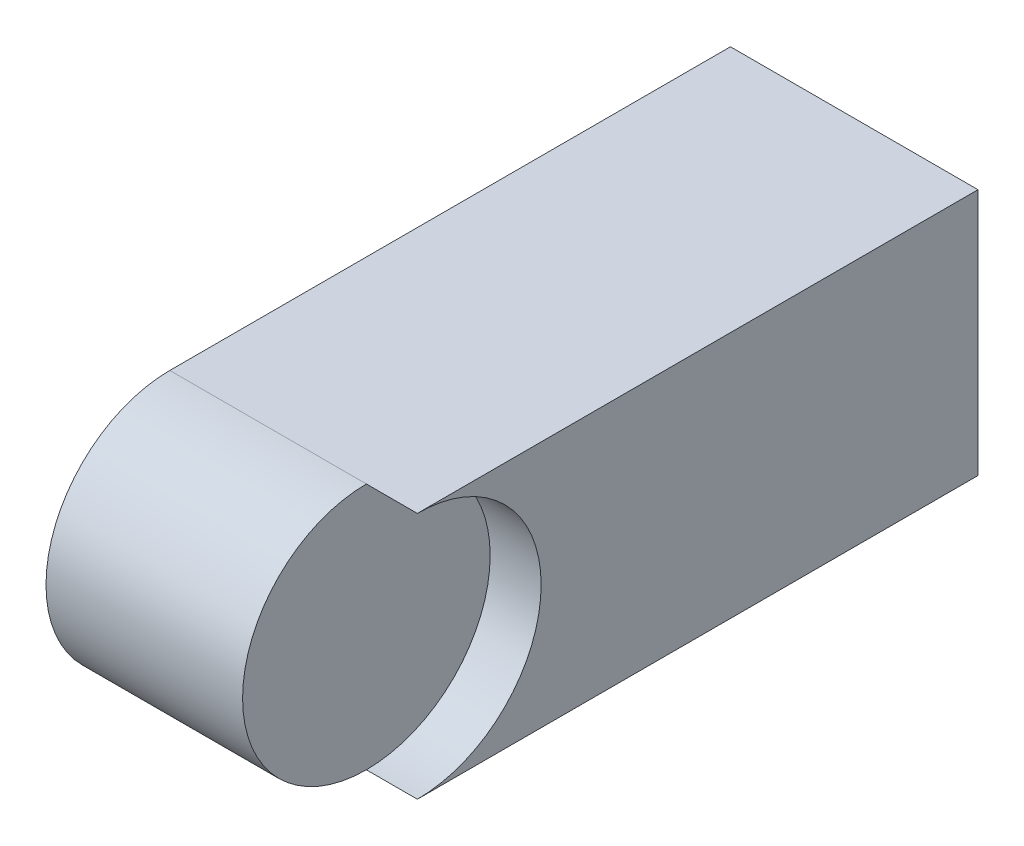
ISO-10303-21;
HEADER;
FILE_DESCRIPTION(('STEP AP214'),'2;1');
FILE_NAME('part.step','',(''),(''),'','','');
FILE_SCHEMA(('AUTOMOTIVE_DESIGN { 1 0 10303 214 1 1 1 1 }'));
ENDSEC;
DATA;
#1=APPLICATION_CONTEXT('core data for automotive mechanical design processes');
#2=APPLICATION_PROTOCOL_DEFINITION('international standard','automotive_design',2000,#1);
#3=PRODUCT_CONTEXT('',#1,'mechanical');
#4=PRODUCT('Part','Part','',(#3));
#5=PRODUCT_RELATED_PRODUCT_CATEGORY('part','',(#4));
#6=PRODUCT_DEFINITION_FORMATION('','',#4);
#7=PRODUCT_DEFINITION_CONTEXT('part definition',#1,'design');
#8=PRODUCT_DEFINITION('design','',#6,#7);
#9=PRODUCT_DEFINITION_SHAPE('','',#8);
#10=(LENGTH_UNIT() NAMED_UNIT(*) SI_UNIT(.MILLI.,.METRE.));
#11=(NAMED_UNIT(*) PLANE_ANGLE_UNIT() SI_UNIT($,.RADIAN.));
#12=(NAMED_UNIT(*) SI_UNIT($,.STERADIAN.) SOLID_ANGLE_UNIT());
#13=UNCERTAINTY_MEASURE_WITH_UNIT(LENGTH_MEASURE(1.E-05),#10,'distance_accuracy_value','');
#14=(GEOMETRIC_REPRESENTATION_CONTEXT(3) GLOBAL_UNCERTAINTY_ASSIGNED_CONTEXT((#13)) GLOBAL_UNIT_ASSIGNED_CONTEXT((#10,
#11,#12)) REPRESENTATION_CONTEXT('',''));
#15=CARTESIAN_POINT('',(0.,0.,0.));
#16=DIRECTION('',(0.,0.,1.));
#17=DIRECTION('',(1.,0.,0.));
#18=AXIS2_PLACEMENT_3D('',#15,#16,#17);
#19=CARTESIAN_POINT('',(-38.5,0.,38.5));
#20=DIRECTION('',(1.,0.,0.));
#21=DIRECTION('',(0.,0.,-1.));
#22=AXIS2_PLACEMENT_3D('',#19,#20,#21);
#23=CYLINDRICAL_SURFACE('',#22,8.5);
#24=DIRECTION('',(1.,0.,0.));
#25=VECTOR('',#24,1.);
#26=CARTESIAN_POINT('',(-38.5,-8.5,38.5));
#27=LINE('',#26,#25);
#28=CARTESIAN_POINT('',(-8.5,-8.5,38.5));
#29=VERTEX_POINT('',#28);
#30=CARTESIAN_POINT('',(5.,-8.5,38.5));
#31=VERTEX_POINT('',#30);
#32=EDGE_CURVE('E125',#29,#31,#27,.T.);
#33=ORIENTED_EDGE('',*,*,#32,.T.);
#34=CARTESIAN_POINT('',(5.,0.,38.5));
#35=DIRECTION('',(1.,0.,0.));
#36=DIRECTION('',(0.,0.,-1.));
#37=AXIS2_PLACEMENT_3D('',#34,#35,#36);
#38=CIRCLE('',#37,8.5);
#39=CARTESIAN_POINT('',(5.,8.5,38.5));
#40=VERTEX_POINT('',#39);
#41=EDGE_CURVE('E114',#40,#31,#38,.T.);
#42=ORIENTED_EDGE('',*,*,#41,.F.);
#43=DIRECTION('',(1.,0.,0.));
#44=VECTOR('',#43,1.);
#45=CARTESIAN_POINT('',(-38.5,8.5,38.5));
#46=LINE('',#45,#44);
#47=CARTESIAN_POINT('',(-8.5,8.5,38.5));
#48=VERTEX_POINT('',#47);
#49=EDGE_CURVE('E113',#48,#40,#46,.T.);
#50=ORIENTED_EDGE('',*,*,#49,.F.);
#51=CARTESIAN_POINT('',(-8.5,0.,38.5));
#52=DIRECTION('',(1.,0.,0.));
#53=DIRECTION('',(0.,0.,-1.));
#54=AXIS2_PLACEMENT_3D('',#51,#52,#53);
#55=CIRCLE('',#54,8.5);
#56=EDGE_CURVE('E121',#48,#29,#55,.T.);
#57=ORIENTED_EDGE('',*,*,#56,.T.);
#58=EDGE_LOOP('',(#33,#42,#50,#57));
#59=FACE_BOUND('',#58,.T.);
#60=ADVANCED_FACE('F51',(#59),#23,.T.);
#61=CARTESIAN_POINT('',(8.5,-8.5,47.));
#62=DIRECTION('',(-1.,0.,0.));
#63=DIRECTION('',(0.,0.,1.));
#64=AXIS2_PLACEMENT_3D('',#61,#62,#63);
#65=PLANE('',#64);
#66=DIRECTION('',(0.,0.,-1.));
#67=VECTOR('',#66,1.);
#68=CARTESIAN_POINT('',(8.5,8.5,47.));
#69=LINE('',#68,#67);
#70=CARTESIAN_POINT('',(8.5,8.5,38.5));
#71=VERTEX_POINT('',#70);
#72=CARTESIAN_POINT('',(8.5,8.5,0.));
#73=VERTEX_POINT('',#72);
#74=EDGE_CURVE('E12',#71,#73,#69,.T.);
#75=ORIENTED_EDGE('',*,*,#74,.F.);
#76=CARTESIAN_POINT('',(8.5,0.,38.5));
#77=DIRECTION('',(1.,0.,0.));
#78=DIRECTION('',(0.,0.,-1.));
#79=AXIS2_PLACEMENT_3D('',#76,#77,#78);
#80=CIRCLE('',#79,8.5);
#81=CARTESIAN_POINT('',(8.5,-8.5,38.5));
#82=VERTEX_POINT('',#81);
#83=EDGE_CURVE('E97',#82,#71,#80,.T.);
#84=ORIENTED_EDGE('',*,*,#83,.F.);
#85=DIRECTION('',(0.,0.,-1.));
#86=VECTOR('',#85,1.);
#87=CARTESIAN_POINT('',(8.5,-8.5,47.));
#88=LINE('',#87,#86);
#89=CARTESIAN_POINT('',(8.5,-8.5,0.));
#90=VERTEX_POINT('',#89);
#91=EDGE_CURVE('E73',#82,#90,#88,.T.);
#92=ORIENTED_EDGE('',*,*,#91,.T.);
#93=DIRECTION('',(0.,1.,0.));
#94=VECTOR('',#93,1.);
#95=CARTESIAN_POINT('',(8.5,-8.5,0.));
#96=LINE('',#95,#94);
#97=EDGE_CURVE('E117',#90,#73,#96,.T.);
#98=ORIENTED_EDGE('',*,*,#97,.T.);
#99=EDGE_LOOP('',(#75,#84,#92,#98));
#100=FACE_BOUND('',#99,.T.);
#101=ADVANCED_FACE('F53',(#100),#65,.F.);
#102=CARTESIAN_POINT('',(-8.5,-8.5,47.));
#103=DIRECTION('',(1.,0.,0.));
#104=DIRECTION('',(0.,0.,-1.));
#105=AXIS2_PLACEMENT_3D('',#102,#103,#104);
#106=PLANE('',#105);
#107=ORIENTED_EDGE('',*,*,#56,.F.);
#108=DIRECTION('',(0.,0.,-1.));
#109=VECTOR('',#108,1.);
#110=CARTESIAN_POINT('',(-8.5,8.5,47.));
#111=LINE('',#110,#109);
#112=CARTESIAN_POINT('',(-8.5,8.5,0.));
#113=VERTEX_POINT('',#112);
#114=EDGE_CURVE('E59',#48,#113,#111,.T.);
#115=ORIENTED_EDGE('',*,*,#114,.T.);
#116=DIRECTION('',(0.,-1.,0.));
#117=VECTOR('',#116,1.);
#118=CARTESIAN_POINT('',(-8.5,-8.5,0.));
#119=LINE('',#118,#117);
#120=CARTESIAN_POINT('',(-8.5,-8.5,0.));
#121=VERTEX_POINT('',#120);
#122=EDGE_CURVE('E123',#113,#121,#119,.T.);
#123=ORIENTED_EDGE('',*,*,#122,.T.);
#124=DIRECTION('',(0.,0.,-1.));
#125=VECTOR('',#124,1.);
#126=CARTESIAN_POINT('',(-8.5,-8.5,47.));
#127=LINE('',#126,#125);
#128=EDGE_CURVE('E134',#29,#121,#127,.T.);
#129=ORIENTED_EDGE('',*,*,#128,.F.);
#130=EDGE_LOOP('',(#107,#115,#123,#129));
#131=FACE_BOUND('',#130,.T.);
#132=ADVANCED_FACE('F136',(#131),#106,.F.);
#133=CARTESIAN_POINT('',(-8.5,-8.5,47.));
#134=DIRECTION('',(0.,1.,0.));
#135=DIRECTION('',(0.,0.,1.));
#136=AXIS2_PLACEMENT_3D('',#133,#134,#135);
#137=PLANE('',#136);
#138=ORIENTED_EDGE('',*,*,#32,.F.);
#139=ORIENTED_EDGE('',*,*,#128,.T.);
#140=DIRECTION('',(1.,0.,0.));
#141=VECTOR('',#140,1.);
#142=CARTESIAN_POINT('',(-8.5,-8.5,0.));
#143=LINE('',#142,#141);
#144=EDGE_CURVE('E131',#121,#90,#143,.T.);
#145=ORIENTED_EDGE('',*,*,#144,.T.);
#146=ORIENTED_EDGE('',*,*,#91,.F.);
#147=EDGE_CURVE('E103',#31,#82,#27,.T.);
#148=ORIENTED_EDGE('',*,*,#147,.F.);
#149=EDGE_LOOP('',(#138,#139,#145,#146,#148));
#150=FACE_BOUND('',#149,.T.);
#151=ADVANCED_FACE('F142',(#150),#137,.F.);
#152=CARTESIAN_POINT('',(-8.5,8.5,47.));
#153=DIRECTION('',(0.,-1.,0.));
#154=DIRECTION('',(0.,0.,-1.));
#155=AXIS2_PLACEMENT_3D('',#152,#153,#154);
#156=PLANE('',#155);
#157=ORIENTED_EDGE('',*,*,#114,.F.);
#158=ORIENTED_EDGE('',*,*,#49,.T.);
#159=EDGE_CURVE('E100',#40,#71,#46,.T.);
#160=ORIENTED_EDGE('',*,*,#159,.T.);
#161=ORIENTED_EDGE('',*,*,#74,.T.);
#162=DIRECTION('',(-1.,0.,0.));
#163=VECTOR('',#162,1.);
#164=CARTESIAN_POINT('',(-8.5,8.5,0.));
#165=LINE('',#164,#163);
#166=EDGE_CURVE('E120',#73,#113,#165,.T.);
#167=ORIENTED_EDGE('',*,*,#166,.T.);
#168=EDGE_LOOP('',(#157,#158,#160,#161,#167));
#169=FACE_BOUND('',#168,.T.);
#170=ADVANCED_FACE('F109',(#169),#156,.F.);
#171=CARTESIAN_POINT('',(0.,0.,0.));
#172=DIRECTION('',(0.,0.,-1.));
#173=DIRECTION('',(-1.,0.,0.));
#174=AXIS2_PLACEMENT_3D('',#171,#172,#173);
#175=PLANE('',#174);
#176=ORIENTED_EDGE('',*,*,#97,.F.);
#177=ORIENTED_EDGE('',*,*,#144,.F.);
#178=ORIENTED_EDGE('',*,*,#122,.F.);
#179=ORIENTED_EDGE('',*,*,#166,.F.);
#180=EDGE_LOOP('',(#176,#177,#178,#179));
#181=FACE_BOUND('',#180,.T.);
#182=ADVANCED_FACE('F139',(#181),#175,.T.);
#183=CARTESIAN_POINT('',(5.,0.,38.5));
#184=DIRECTION('',(1.,0.,0.));
#185=DIRECTION('',(0.,0.,-1.));
#186=AXIS2_PLACEMENT_3D('',#183,#184,#185);
#187=CYLINDRICAL_SURFACE('',#186,8.5);
#188=ORIENTED_EDGE('',*,*,#147,.T.);
#189=ORIENTED_EDGE('',*,*,#83,.T.);
#190=ORIENTED_EDGE('',*,*,#159,.F.);
#191=EDGE_CURVE('E65',#31,#40,#38,.T.);
#192=ORIENTED_EDGE('',*,*,#191,.F.);
#193=EDGE_LOOP('',(#188,#189,#190,#192));
#194=FACE_BOUND('',#193,.T.);
#195=ADVANCED_FACE('F99',(#194),#187,.F.);
#196=CARTESIAN_POINT('',(5.,0.,38.5));
#197=DIRECTION('',(1.,0.,0.));
#198=DIRECTION('',(0.,0.,-1.));
#199=AXIS2_PLACEMENT_3D('',#196,#197,#198);
#200=PLANE('',#199);
#201=ORIENTED_EDGE('',*,*,#41,.T.);
#202=ORIENTED_EDGE('',*,*,#191,.T.);
#203=EDGE_LOOP('',(#201,#202));
#204=FACE_BOUND('',#203,.T.);
#205=ADVANCED_FACE('F146',(#204),#200,.T.);
#206=CLOSED_SHELL('',(#60,#101,#132,#151,#170,#182,#195,#205));
#207=MANIFOLD_SOLID_BREP('B2',#206);
#208=ADVANCED_BREP_SHAPE_REPRESENTATION('',(#18,#207),#14);
#209=SHAPE_DEFINITION_REPRESENTATION(#9,#208);
ENDSEC;
END-ISO-10303-21;
